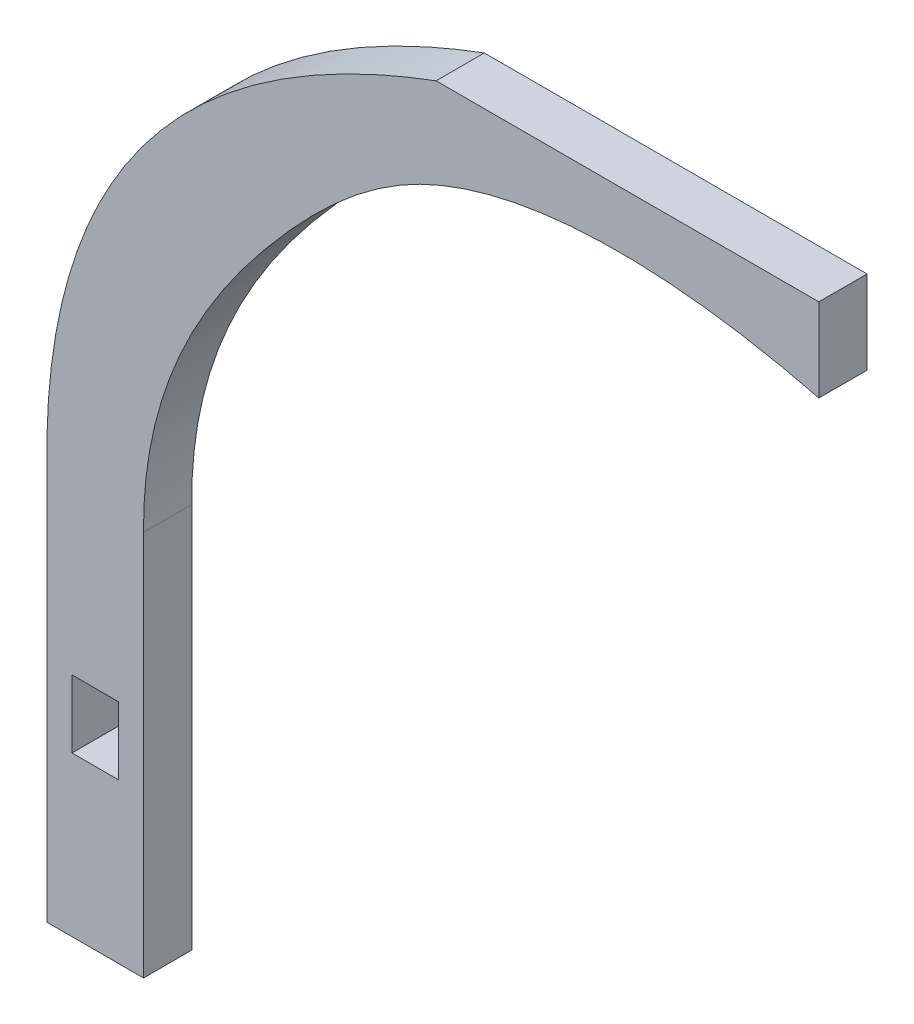
ISO-10303-21;
HEADER;
FILE_DESCRIPTION(('STEP AP214'),'2;1');
FILE_NAME('part.step','',(''),(''),'','','');
FILE_SCHEMA(('AUTOMOTIVE_DESIGN { 1 0 10303 214 1 1 1 1 }'));
ENDSEC;
DATA;
#1=APPLICATION_CONTEXT('core data for automotive mechanical design processes');
#2=APPLICATION_PROTOCOL_DEFINITION('international standard','automotive_design',2000,#1);
#3=PRODUCT_CONTEXT('',#1,'mechanical');
#4=PRODUCT('Part','Part','',(#3));
#5=PRODUCT_RELATED_PRODUCT_CATEGORY('part','',(#4));
#6=PRODUCT_DEFINITION_FORMATION('','',#4);
#7=PRODUCT_DEFINITION_CONTEXT('part definition',#1,'design');
#8=PRODUCT_DEFINITION('design','',#6,#7);
#9=PRODUCT_DEFINITION_SHAPE('','',#8);
#10=(LENGTH_UNIT() NAMED_UNIT(*) SI_UNIT(.MILLI.,.METRE.));
#11=(NAMED_UNIT(*) PLANE_ANGLE_UNIT() SI_UNIT($,.RADIAN.));
#12=(NAMED_UNIT(*) SI_UNIT($,.STERADIAN.) SOLID_ANGLE_UNIT());
#13=UNCERTAINTY_MEASURE_WITH_UNIT(LENGTH_MEASURE(1.E-05),#10,'distance_accuracy_value','');
#14=(GEOMETRIC_REPRESENTATION_CONTEXT(3) GLOBAL_UNCERTAINTY_ASSIGNED_CONTEXT((#13)) GLOBAL_UNIT_ASSIGNED_CONTEXT((#10,
#11,#12)) REPRESENTATION_CONTEXT('',''));
#15=CARTESIAN_POINT('',(0.,0.,0.));
#16=DIRECTION('',(0.,0.,1.));
#17=DIRECTION('',(1.,0.,0.));
#18=AXIS2_PLACEMENT_3D('',#15,#16,#17);
#19=CARTESIAN_POINT('',(2.413,0.,5.));
#20=DIRECTION('',(-1.,0.,0.));
#21=DIRECTION('',(0.,0.,1.));
#22=AXIS2_PLACEMENT_3D('',#19,#20,#21);
#23=PLANE('',#22);
#24=DIRECTION('',(0.,1.,0.));
#25=VECTOR('',#24,1.);
#26=CARTESIAN_POINT('',(2.413,0.,0.));
#27=LINE('',#26,#25);
#28=CARTESIAN_POINT('',(2.413,-3.5052,0.));
#29=VERTEX_POINT('',#28);
#30=CARTESIAN_POINT('',(2.413,3.5052,0.));
#31=VERTEX_POINT('',#30);
#32=EDGE_CURVE('E184',#29,#31,#27,.T.);
#33=ORIENTED_EDGE('',*,*,#32,.F.);
#34=DIRECTION('',(0.,0.,-1.));
#35=VECTOR('',#34,1.);
#36=CARTESIAN_POINT('',(2.413,-3.5052,5.));
#37=LINE('',#36,#35);
#38=CARTESIAN_POINT('',(2.413,-3.5052,5.));
#39=VERTEX_POINT('',#38);
#40=EDGE_CURVE('E11',#39,#29,#37,.T.);
#41=ORIENTED_EDGE('',*,*,#40,.F.);
#42=DIRECTION('',(0.,1.,0.));
#43=VECTOR('',#42,1.);
#44=CARTESIAN_POINT('',(2.413,0.,5.));
#45=LINE('',#44,#43);
#46=CARTESIAN_POINT('',(2.413,3.5052,5.));
#47=VERTEX_POINT('',#46);
#48=EDGE_CURVE('E146',#39,#47,#45,.T.);
#49=ORIENTED_EDGE('',*,*,#48,.T.);
#50=DIRECTION('',(0.,0.,-1.));
#51=VECTOR('',#50,1.);
#52=CARTESIAN_POINT('',(2.413,3.5052,5.));
#53=LINE('',#52,#51);
#54=EDGE_CURVE('E99',#47,#31,#53,.T.);
#55=ORIENTED_EDGE('',*,*,#54,.T.);
#56=EDGE_LOOP('',(#33,#41,#49,#55));
#57=FACE_BOUND('',#56,.T.);
#58=ADVANCED_FACE('F35',(#57),#23,.T.);
#59=CARTESIAN_POINT('',(0.,-3.5052,5.));
#60=DIRECTION('',(0.,1.,0.));
#61=DIRECTION('',(0.,0.,1.));
#62=AXIS2_PLACEMENT_3D('',#59,#60,#61);
#63=PLANE('',#62);
#64=DIRECTION('',(1.,0.,0.));
#65=VECTOR('',#64,1.);
#66=CARTESIAN_POINT('',(0.,-3.5052,0.));
#67=LINE('',#66,#65);
#68=CARTESIAN_POINT('',(-2.413,-3.5052,0.));
#69=VERTEX_POINT('',#68);
#70=EDGE_CURVE('E136',#69,#29,#67,.T.);
#71=ORIENTED_EDGE('',*,*,#70,.F.);
#72=DIRECTION('',(0.,0.,-1.));
#73=VECTOR('',#72,1.);
#74=CARTESIAN_POINT('',(-2.413,-3.5052,5.));
#75=LINE('',#74,#73);
#76=CARTESIAN_POINT('',(-2.413,-3.5052,5.));
#77=VERTEX_POINT('',#76);
#78=EDGE_CURVE('E46',#77,#69,#75,.T.);
#79=ORIENTED_EDGE('',*,*,#78,.F.);
#80=DIRECTION('',(1.,0.,0.));
#81=VECTOR('',#80,1.);
#82=CARTESIAN_POINT('',(0.,-3.5052,5.));
#83=LINE('',#82,#81);
#84=EDGE_CURVE('E134',#77,#39,#83,.T.);
#85=ORIENTED_EDGE('',*,*,#84,.T.);
#86=ORIENTED_EDGE('',*,*,#40,.T.);
#87=EDGE_LOOP('',(#71,#79,#85,#86));
#88=FACE_BOUND('',#87,.T.);
#89=ADVANCED_FACE('F132',(#88),#63,.T.);
#90=CARTESIAN_POINT('',(-2.413,0.,5.));
#91=DIRECTION('',(-1.,0.,0.));
#92=DIRECTION('',(0.,0.,1.));
#93=AXIS2_PLACEMENT_3D('',#90,#91,#92);
#94=PLANE('',#93);
#95=DIRECTION('',(0.,1.,0.));
#96=VECTOR('',#95,1.);
#97=CARTESIAN_POINT('',(-2.413,0.,0.));
#98=LINE('',#97,#96);
#99=CARTESIAN_POINT('',(-2.413,3.5052,0.));
#100=VERTEX_POINT('',#99);
#101=EDGE_CURVE('E187',#69,#100,#98,.T.);
#102=ORIENTED_EDGE('',*,*,#101,.T.);
#103=DIRECTION('',(0.,0.,-1.));
#104=VECTOR('',#103,1.);
#105=CARTESIAN_POINT('',(-2.413,3.5052,5.));
#106=LINE('',#105,#104);
#107=CARTESIAN_POINT('',(-2.413,3.5052,5.));
#108=VERTEX_POINT('',#107);
#109=EDGE_CURVE('E139',#108,#100,#106,.T.);
#110=ORIENTED_EDGE('',*,*,#109,.F.);
#111=DIRECTION('',(0.,1.,0.));
#112=VECTOR('',#111,1.);
#113=CARTESIAN_POINT('',(-2.413,0.,5.));
#114=LINE('',#113,#112);
#115=EDGE_CURVE('E142',#77,#108,#114,.T.);
#116=ORIENTED_EDGE('',*,*,#115,.F.);
#117=ORIENTED_EDGE('',*,*,#78,.T.);
#118=EDGE_LOOP('',(#102,#110,#116,#117));
#119=FACE_BOUND('',#118,.T.);
#120=ADVANCED_FACE('F143',(#119),#94,.F.);
#121=CARTESIAN_POINT('',(75.,67.0594842008114,5.));
#122=CARTESIAN_POINT('',(62.0309347700768,70.3669279191831,5.));
#123=CARTESIAN_POINT('',(38.2696494006954,72.4068913813896,5.));
#124=CARTESIAN_POINT('',(13.9373301003139,49.417587766706,5.));
#125=CARTESIAN_POINT('',(4.87554091679526,33.4479306139866,5.));
#126=CARTESIAN_POINT('',(5.,20.,5.));
#127=B_SPLINE_CURVE_WITH_KNOTS('',3,(#121,#122,#123,#124,#125,#126),.UNSPECIFIED.,.F.,.F.,(4,1,
1,4),(0.,0.44426083661879,0.615865685704177,1.),.UNSPECIFIED.);
#128=DIRECTION('',(0.,0.,-1.));
#129=VECTOR('',#128,1.);
#130=SURFACE_OF_LINEAR_EXTRUSION('',#127,#129);
#131=CARTESIAN_POINT('',(75.,67.0594842008114,0.));
#132=CARTESIAN_POINT('',(62.0309347700768,70.3669279191831,0.));
#133=CARTESIAN_POINT('',(38.2696494006954,72.4068913813896,0.));
#134=CARTESIAN_POINT('',(13.9373301003139,49.417587766706,0.));
#135=CARTESIAN_POINT('',(4.87554091679526,33.4479306139866,0.));
#136=CARTESIAN_POINT('',(5.,20.,0.));
#137=B_SPLINE_CURVE_WITH_KNOTS('',3,(#131,#132,#133,#134,#135,#136),.UNSPECIFIED.,.F.,.F.,(4,1,
1,4),(0.,0.44426083661879,0.615865685704177,1.),.UNSPECIFIED.);
#138=CARTESIAN_POINT('',(75.,67.0594842008114,0.));
#139=VERTEX_POINT('',#138);
#140=CARTESIAN_POINT('',(5.,20.,0.));
#141=VERTEX_POINT('',#140);
#142=EDGE_CURVE('E154',#139,#141,#137,.T.);
#143=ORIENTED_EDGE('',*,*,#142,.F.);
#144=DIRECTION('',(0.,0.,-1.));
#145=VECTOR('',#144,1.);
#146=CARTESIAN_POINT('',(75.,67.0594842008114,5.));
#147=LINE('',#146,#145);
#148=CARTESIAN_POINT('',(75.,67.0594842008114,5.));
#149=VERTEX_POINT('',#148);
#150=EDGE_CURVE('E40',#149,#139,#147,.T.);
#151=ORIENTED_EDGE('',*,*,#150,.F.);
#152=CARTESIAN_POINT('',(5.,20.,5.));
#153=VERTEX_POINT('',#152);
#154=EDGE_CURVE('E190',#149,#153,#127,.T.);
#155=ORIENTED_EDGE('',*,*,#154,.T.);
#156=DIRECTION('',(0.,0.,-1.));
#157=VECTOR('',#156,1.);
#158=CARTESIAN_POINT('',(5.,20.,5.));
#159=LINE('',#158,#157);
#160=EDGE_CURVE('E153',#153,#141,#159,.T.);
#161=ORIENTED_EDGE('',*,*,#160,.T.);
#162=EDGE_LOOP('',(#143,#151,#155,#161));
#163=FACE_BOUND('',#162,.T.);
#164=ADVANCED_FACE('F37',(#163),#130,.T.);
#165=CARTESIAN_POINT('',(75.,0.,5.));
#166=DIRECTION('',(1.,0.,0.));
#167=DIRECTION('',(0.,0.,-1.));
#168=AXIS2_PLACEMENT_3D('',#165,#166,#167);
#169=PLANE('',#168);
#170=DIRECTION('',(0.,-1.,0.));
#171=VECTOR('',#170,1.);
#172=CARTESIAN_POINT('',(75.,0.,0.));
#173=LINE('',#172,#171);
#174=CARTESIAN_POINT('',(75.,75.6987951429835,0.));
#175=VERTEX_POINT('',#174);
#176=EDGE_CURVE('E159',#175,#139,#173,.T.);
#177=ORIENTED_EDGE('',*,*,#176,.F.);
#178=DIRECTION('',(0.,0.,-1.));
#179=VECTOR('',#178,1.);
#180=CARTESIAN_POINT('',(75.,75.6987951429835,5.));
#181=LINE('',#180,#179);
#182=CARTESIAN_POINT('',(75.,75.6987951429835,5.));
#183=VERTEX_POINT('',#182);
#184=EDGE_CURVE('E202',#183,#175,#181,.T.);
#185=ORIENTED_EDGE('',*,*,#184,.F.);
#186=DIRECTION('',(0.,-1.,0.));
#187=VECTOR('',#186,1.);
#188=CARTESIAN_POINT('',(75.,0.,5.));
#189=LINE('',#188,#187);
#190=EDGE_CURVE('E211',#183,#149,#189,.T.);
#191=ORIENTED_EDGE('',*,*,#190,.T.);
#192=ORIENTED_EDGE('',*,*,#150,.T.);
#193=EDGE_LOOP('',(#177,#185,#191,#192));
#194=FACE_BOUND('',#193,.T.);
#195=ADVANCED_FACE('F209',(#194),#169,.T.);
#196=CARTESIAN_POINT('',(0.,75.6987951429835,5.));
#197=DIRECTION('',(0.,1.,0.));
#198=DIRECTION('',(0.,0.,1.));
#199=AXIS2_PLACEMENT_3D('',#196,#197,#198);
#200=PLANE('',#199);
#201=DIRECTION('',(1.,0.,0.));
#202=VECTOR('',#201,1.);
#203=CARTESIAN_POINT('',(0.,75.6987951429835,0.));
#204=LINE('',#203,#202);
#205=CARTESIAN_POINT('',(35.3257498629524,75.6987951429835,0.));
#206=VERTEX_POINT('',#205);
#207=EDGE_CURVE('E165',#206,#175,#204,.T.);
#208=ORIENTED_EDGE('',*,*,#207,.F.);
#209=DIRECTION('',(0.,0.,-1.));
#210=VECTOR('',#209,1.);
#211=CARTESIAN_POINT('',(35.3257498629524,75.6987951429835,5.));
#212=LINE('',#211,#210);
#213=CARTESIAN_POINT('',(35.3257498629524,75.6987951429835,5.));
#214=VERTEX_POINT('',#213);
#215=EDGE_CURVE('E201',#214,#206,#212,.T.);
#216=ORIENTED_EDGE('',*,*,#215,.F.);
#217=DIRECTION('',(1.,0.,0.));
#218=VECTOR('',#217,1.);
#219=CARTESIAN_POINT('',(0.,75.6987951429835,5.));
#220=LINE('',#219,#218);
#221=EDGE_CURVE('E219',#214,#183,#220,.T.);
#222=ORIENTED_EDGE('',*,*,#221,.T.);
#223=ORIENTED_EDGE('',*,*,#184,.T.);
#224=EDGE_LOOP('',(#208,#216,#222,#223));
#225=FACE_BOUND('',#224,.T.);
#226=ADVANCED_FACE('F217',(#225),#200,.T.);
#227=CARTESIAN_POINT('',(-5.,20.,5.));
#228=CARTESIAN_POINT('',(-6.08305701774497,60.3796993705521,5.));
#229=CARTESIAN_POINT('',(35.3257498629525,75.6987951429835,5.));
#230=B_SPLINE_CURVE_WITH_KNOTS('',2,(#227,#228,#229),.UNSPECIFIED.,.F.,.F.,(3,3),(0.,1.),.UNSPECIFIED.);
#231=DIRECTION('',(0.,0.,-1.));
#232=VECTOR('',#231,1.);
#233=SURFACE_OF_LINEAR_EXTRUSION('',#230,#232);
#234=CARTESIAN_POINT('',(-5.,20.,0.));
#235=CARTESIAN_POINT('',(-6.08305701774497,60.3796993705521,0.));
#236=CARTESIAN_POINT('',(35.3257498629525,75.6987951429835,0.));
#237=B_SPLINE_CURVE_WITH_KNOTS('',2,(#234,#235,#236),.UNSPECIFIED.,.F.,.F.,(3,3),(0.,1.),.UNSPECIFIED.);
#238=CARTESIAN_POINT('',(-5.,20.,0.));
#239=VERTEX_POINT('',#238);
#240=EDGE_CURVE('E168',#239,#206,#237,.T.);
#241=ORIENTED_EDGE('',*,*,#240,.F.);
#242=DIRECTION('',(0.,0.,-1.));
#243=VECTOR('',#242,1.);
#244=CARTESIAN_POINT('',(-5.,20.,5.));
#245=LINE('',#244,#243);
#246=CARTESIAN_POINT('',(-5.,20.,5.));
#247=VERTEX_POINT('',#246);
#248=EDGE_CURVE('E199',#247,#239,#245,.T.);
#249=ORIENTED_EDGE('',*,*,#248,.F.);
#250=EDGE_CURVE('E224',#247,#214,#230,.T.);
#251=ORIENTED_EDGE('',*,*,#250,.T.);
#252=ORIENTED_EDGE('',*,*,#215,.T.);
#253=EDGE_LOOP('',(#241,#249,#251,#252));
#254=FACE_BOUND('',#253,.T.);
#255=ADVANCED_FACE('F226',(#254),#233,.T.);
#256=CARTESIAN_POINT('',(-5.,0.,5.));
#257=DIRECTION('',(1.,0.,0.));
#258=DIRECTION('',(0.,1.,0.));
#259=AXIS2_PLACEMENT_3D('',#256,#257,#258);
#260=PLANE('',#259);
#261=DIRECTION('',(0.,-1.,0.));
#262=VECTOR('',#261,1.);
#263=CARTESIAN_POINT('',(-5.,0.,0.));
#264=LINE('',#263,#262);
#265=CARTESIAN_POINT('',(-5.,-20.,0.));
#266=VERTEX_POINT('',#265);
#267=EDGE_CURVE('E173',#239,#266,#264,.T.);
#268=ORIENTED_EDGE('',*,*,#267,.T.);
#269=DIRECTION('',(0.,0.,-1.));
#270=VECTOR('',#269,1.);
#271=CARTESIAN_POINT('',(-5.,-20.,5.));
#272=LINE('',#271,#270);
#273=CARTESIAN_POINT('',(-5.,-20.,5.));
#274=VERTEX_POINT('',#273);
#275=EDGE_CURVE('E196',#274,#266,#272,.T.);
#276=ORIENTED_EDGE('',*,*,#275,.F.);
#277=DIRECTION('',(0.,-1.,0.));
#278=VECTOR('',#277,1.);
#279=CARTESIAN_POINT('',(-5.,0.,5.));
#280=LINE('',#279,#278);
#281=EDGE_CURVE('E228',#247,#274,#280,.T.);
#282=ORIENTED_EDGE('',*,*,#281,.F.);
#283=ORIENTED_EDGE('',*,*,#248,.T.);
#284=EDGE_LOOP('',(#268,#276,#282,#283));
#285=FACE_BOUND('',#284,.T.);
#286=ADVANCED_FACE('F244',(#285),#260,.F.);
#287=CARTESIAN_POINT('',(0.,-20.,5.));
#288=DIRECTION('',(0.,1.,0.));
#289=DIRECTION('',(0.,0.,1.));
#290=AXIS2_PLACEMENT_3D('',#287,#288,#289);
#291=PLANE('',#290);
#292=DIRECTION('',(1.,0.,0.));
#293=VECTOR('',#292,1.);
#294=CARTESIAN_POINT('',(0.,-20.,0.));
#295=LINE('',#294,#293);
#296=CARTESIAN_POINT('',(5.,-20.,0.));
#297=VERTEX_POINT('',#296);
#298=EDGE_CURVE('E178',#266,#297,#295,.T.);
#299=ORIENTED_EDGE('',*,*,#298,.T.);
#300=DIRECTION('',(0.,0.,-1.));
#301=VECTOR('',#300,1.);
#302=CARTESIAN_POINT('',(5.,-20.,5.));
#303=LINE('',#302,#301);
#304=CARTESIAN_POINT('',(5.,-20.,5.));
#305=VERTEX_POINT('',#304);
#306=EDGE_CURVE('E194',#305,#297,#303,.T.);
#307=ORIENTED_EDGE('',*,*,#306,.F.);
#308=DIRECTION('',(1.,0.,0.));
#309=VECTOR('',#308,1.);
#310=CARTESIAN_POINT('',(0.,-20.,5.));
#311=LINE('',#310,#309);
#312=EDGE_CURVE('E230',#274,#305,#311,.T.);
#313=ORIENTED_EDGE('',*,*,#312,.F.);
#314=ORIENTED_EDGE('',*,*,#275,.T.);
#315=EDGE_LOOP('',(#299,#307,#313,#314));
#316=FACE_BOUND('',#315,.T.);
#317=ADVANCED_FACE('F262',(#316),#291,.F.);
#318=CARTESIAN_POINT('',(5.,0.,5.));
#319=DIRECTION('',(1.,0.,0.));
#320=DIRECTION('',(0.,1.,0.));
#321=AXIS2_PLACEMENT_3D('',#318,#319,#320);
#322=PLANE('',#321);
#323=DIRECTION('',(0.,-1.,0.));
#324=VECTOR('',#323,1.);
#325=CARTESIAN_POINT('',(5.,0.,0.));
#326=LINE('',#325,#324);
#327=EDGE_CURVE('E181',#141,#297,#326,.T.);
#328=ORIENTED_EDGE('',*,*,#327,.F.);
#329=ORIENTED_EDGE('',*,*,#160,.F.);
#330=DIRECTION('',(0.,-1.,0.));
#331=VECTOR('',#330,1.);
#332=CARTESIAN_POINT('',(5.,0.,5.));
#333=LINE('',#332,#331);
#334=EDGE_CURVE('E148',#153,#305,#333,.T.);
#335=ORIENTED_EDGE('',*,*,#334,.T.);
#336=ORIENTED_EDGE('',*,*,#306,.T.);
#337=EDGE_LOOP('',(#328,#329,#335,#336));
#338=FACE_BOUND('',#337,.T.);
#339=ADVANCED_FACE('F259',(#338),#322,.T.);
#340=CARTESIAN_POINT('',(0.,3.5052,5.));
#341=DIRECTION('',(0.,1.,0.));
#342=DIRECTION('',(0.,0.,1.));
#343=AXIS2_PLACEMENT_3D('',#340,#341,#342);
#344=PLANE('',#343);
#345=DIRECTION('',(1.,0.,0.));
#346=VECTOR('',#345,1.);
#347=CARTESIAN_POINT('',(0.,3.5052,0.));
#348=LINE('',#347,#346);
#349=EDGE_CURVE('E92',#100,#31,#348,.T.);
#350=ORIENTED_EDGE('',*,*,#349,.T.);
#351=ORIENTED_EDGE('',*,*,#54,.F.);
#352=DIRECTION('',(1.,0.,0.));
#353=VECTOR('',#352,1.);
#354=CARTESIAN_POINT('',(0.,3.5052,5.));
#355=LINE('',#354,#353);
#356=EDGE_CURVE('E55',#108,#47,#355,.T.);
#357=ORIENTED_EDGE('',*,*,#356,.F.);
#358=ORIENTED_EDGE('',*,*,#109,.T.);
#359=EDGE_LOOP('',(#350,#351,#357,#358));
#360=FACE_BOUND('',#359,.T.);
#361=ADVANCED_FACE('F261',(#360),#344,.F.);
#362=CARTESIAN_POINT('',(0.,0.,5.));
#363=DIRECTION('',(0.,0.,1.));
#364=DIRECTION('',(1.,0.,0.));
#365=AXIS2_PLACEMENT_3D('',#362,#363,#364);
#366=PLANE('',#365);
#367=ORIENTED_EDGE('',*,*,#154,.F.);
#368=ORIENTED_EDGE('',*,*,#190,.F.);
#369=ORIENTED_EDGE('',*,*,#221,.F.);
#370=ORIENTED_EDGE('',*,*,#250,.F.);
#371=ORIENTED_EDGE('',*,*,#281,.T.);
#372=ORIENTED_EDGE('',*,*,#312,.T.);
#373=ORIENTED_EDGE('',*,*,#334,.F.);
#374=EDGE_LOOP('',(#367,#368,#369,#370,#371,#372,#373));
#375=FACE_BOUND('',#374,.T.);
#376=ORIENTED_EDGE('',*,*,#48,.F.);
#377=ORIENTED_EDGE('',*,*,#84,.F.);
#378=ORIENTED_EDGE('',*,*,#115,.T.);
#379=ORIENTED_EDGE('',*,*,#356,.T.);
#380=EDGE_LOOP('',(#376,#377,#378,#379));
#381=FACE_BOUND('',#380,.T.);
#382=ADVANCED_FACE('F145',(#375,#381),#366,.T.);
#383=CARTESIAN_POINT('',(0.,0.,0.));
#384=DIRECTION('',(0.,0.,1.));
#385=DIRECTION('',(1.,0.,0.));
#386=AXIS2_PLACEMENT_3D('',#383,#384,#385);
#387=PLANE('',#386);
#388=ORIENTED_EDGE('',*,*,#142,.T.);
#389=ORIENTED_EDGE('',*,*,#327,.T.);
#390=ORIENTED_EDGE('',*,*,#298,.F.);
#391=ORIENTED_EDGE('',*,*,#267,.F.);
#392=ORIENTED_EDGE('',*,*,#240,.T.);
#393=ORIENTED_EDGE('',*,*,#207,.T.);
#394=ORIENTED_EDGE('',*,*,#176,.T.);
#395=EDGE_LOOP('',(#388,#389,#390,#391,#392,#393,#394));
#396=FACE_BOUND('',#395,.T.);
#397=ORIENTED_EDGE('',*,*,#32,.T.);
#398=ORIENTED_EDGE('',*,*,#349,.F.);
#399=ORIENTED_EDGE('',*,*,#101,.F.);
#400=ORIENTED_EDGE('',*,*,#70,.T.);
#401=EDGE_LOOP('',(#397,#398,#399,#400));
#402=FACE_BOUND('',#401,.T.);
#403=ADVANCED_FACE('F214',(#396,#402),#387,.F.);
#404=CLOSED_SHELL('',(#58,#89,#120,#164,#195,#226,#255,#286,#317,#339,#361,#382,#403));
#405=MANIFOLD_SOLID_BREP('B2',#404);
#406=ADVANCED_BREP_SHAPE_REPRESENTATION('',(#18,#405),#14);
#407=SHAPE_DEFINITION_REPRESENTATION(#9,#406);
ENDSEC;
END-ISO-10303-21;
